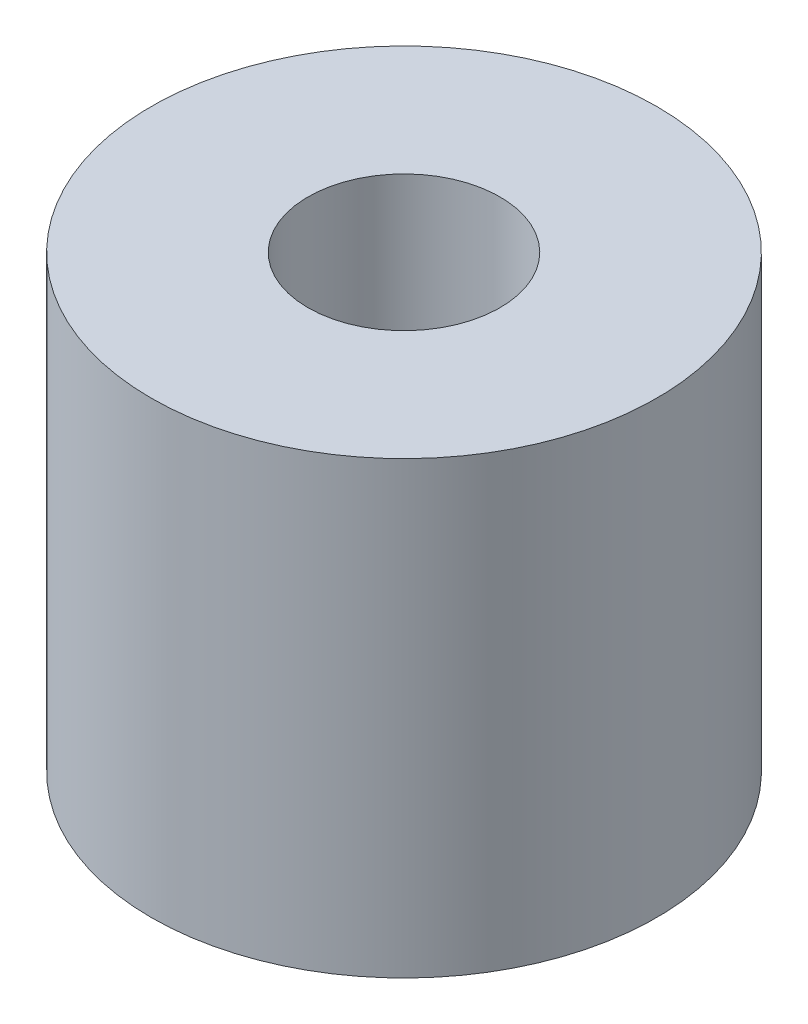
ISO-10303-21;
HEADER;
FILE_DESCRIPTION(('STEP AP214'),'2;1');
FILE_NAME('part.step','',(''),(''),'','','');
FILE_SCHEMA(('AUTOMOTIVE_DESIGN { 1 0 10303 214 1 1 1 1 }'));
ENDSEC;
DATA;
#1=APPLICATION_CONTEXT('core data for automotive mechanical design processes');
#2=APPLICATION_PROTOCOL_DEFINITION('international standard','automotive_design',2000,#1);
#3=PRODUCT_CONTEXT('',#1,'mechanical');
#4=PRODUCT('Part','Part','',(#3));
#5=PRODUCT_RELATED_PRODUCT_CATEGORY('part','',(#4));
#6=PRODUCT_DEFINITION_FORMATION('','',#4);
#7=PRODUCT_DEFINITION_CONTEXT('part definition',#1,'design');
#8=PRODUCT_DEFINITION('design','',#6,#7);
#9=PRODUCT_DEFINITION_SHAPE('','',#8);
#10=(LENGTH_UNIT() NAMED_UNIT(*) SI_UNIT(.MILLI.,.METRE.));
#11=(NAMED_UNIT(*) PLANE_ANGLE_UNIT() SI_UNIT($,.RADIAN.));
#12=(NAMED_UNIT(*) SI_UNIT($,.STERADIAN.) SOLID_ANGLE_UNIT());
#13=UNCERTAINTY_MEASURE_WITH_UNIT(LENGTH_MEASURE(1.E-05),#10,'distance_accuracy_value','');
#14=(GEOMETRIC_REPRESENTATION_CONTEXT(3) GLOBAL_UNCERTAINTY_ASSIGNED_CONTEXT((#13)) GLOBAL_UNIT_ASSIGNED_CONTEXT((#10,
#11,#12)) REPRESENTATION_CONTEXT('',''));
#15=CARTESIAN_POINT('',(0.,0.,0.));
#16=DIRECTION('',(0.,0.,1.));
#17=DIRECTION('',(1.,0.,0.));
#18=AXIS2_PLACEMENT_3D('',#15,#16,#17);
#19=CARTESIAN_POINT('',(0.,22.606,0.));
#20=DIRECTION('',(0.,1.,0.));
#21=DIRECTION('',(0.,0.,1.));
#22=AXIS2_PLACEMENT_3D('',#19,#20,#21);
#23=PLANE('',#22);
#24=CARTESIAN_POINT('',(0.,22.606,0.));
#25=DIRECTION('',(0.,1.,0.));
#26=DIRECTION('',(0.,0.,1.));
#27=AXIS2_PLACEMENT_3D('',#24,#25,#26);
#28=CIRCLE('',#27,12.7);
#29=CARTESIAN_POINT('',(0.,22.606,12.7));
#30=VERTEX_POINT('',#29);
#31=EDGE_CURVE('E10',#30,#30,#28,.T.);
#32=ORIENTED_EDGE('',*,*,#31,.T.);
#33=EDGE_LOOP('',(#32));
#34=FACE_BOUND('',#33,.T.);
#35=CARTESIAN_POINT('',(0.,22.606,0.));
#36=DIRECTION('',(0.,1.,0.));
#37=DIRECTION('',(0.,0.,1.));
#38=AXIS2_PLACEMENT_3D('',#35,#36,#37);
#39=CIRCLE('',#38,4.826);
#40=CARTESIAN_POINT('',(0.,22.606,4.826));
#41=VERTEX_POINT('',#40);
#42=EDGE_CURVE('E42',#41,#41,#39,.T.);
#43=ORIENTED_EDGE('',*,*,#42,.F.);
#44=EDGE_LOOP('',(#43));
#45=FACE_BOUND('',#44,.T.);
#46=ADVANCED_FACE('F31',(#34,#45),#23,.T.);
#47=CARTESIAN_POINT('',(0.,0.,0.));
#48=DIRECTION('',(0.,1.,0.));
#49=DIRECTION('',(0.,0.,1.));
#50=AXIS2_PLACEMENT_3D('',#47,#48,#49);
#51=PLANE('',#50);
#52=CARTESIAN_POINT('',(0.,0.,0.));
#53=DIRECTION('',(0.,1.,0.));
#54=DIRECTION('',(0.,0.,1.));
#55=AXIS2_PLACEMENT_3D('',#52,#53,#54);
#56=CIRCLE('',#55,12.7);
#57=CARTESIAN_POINT('',(0.,0.,12.7));
#58=VERTEX_POINT('',#57);
#59=EDGE_CURVE('E35',#58,#58,#56,.T.);
#60=ORIENTED_EDGE('',*,*,#59,.F.);
#61=EDGE_LOOP('',(#60));
#62=FACE_BOUND('',#61,.T.);
#63=CARTESIAN_POINT('',(0.,0.,0.));
#64=DIRECTION('',(0.,1.,0.));
#65=DIRECTION('',(0.,0.,1.));
#66=AXIS2_PLACEMENT_3D('',#63,#64,#65);
#67=CIRCLE('',#66,4.826);
#68=CARTESIAN_POINT('',(0.,0.,4.826));
#69=VERTEX_POINT('',#68);
#70=EDGE_CURVE('E44',#69,#69,#67,.T.);
#71=ORIENTED_EDGE('',*,*,#70,.T.);
#72=EDGE_LOOP('',(#71));
#73=FACE_BOUND('',#72,.T.);
#74=ADVANCED_FACE('F54',(#62,#73),#51,.F.);
#75=CARTESIAN_POINT('',(0.,22.606,0.));
#76=DIRECTION('',(0.,-1.,0.));
#77=DIRECTION('',(0.,0.,-1.));
#78=AXIS2_PLACEMENT_3D('',#75,#76,#77);
#79=CYLINDRICAL_SURFACE('',#78,12.7);
#80=ORIENTED_EDGE('',*,*,#31,.F.);
#81=EDGE_LOOP('',(#80));
#82=FACE_BOUND('',#81,.T.);
#83=ORIENTED_EDGE('',*,*,#59,.T.);
#84=EDGE_LOOP('',(#83));
#85=FACE_BOUND('',#84,.T.);
#86=ADVANCED_FACE('F33',(#82,#85),#79,.T.);
#87=CARTESIAN_POINT('',(0.,22.606,0.));
#88=DIRECTION('',(0.,-1.,0.));
#89=DIRECTION('',(0.,0.,-1.));
#90=AXIS2_PLACEMENT_3D('',#87,#88,#89);
#91=CYLINDRICAL_SURFACE('',#90,4.826);
#92=ORIENTED_EDGE('',*,*,#42,.T.);
#93=EDGE_LOOP('',(#92));
#94=FACE_BOUND('',#93,.T.);
#95=ORIENTED_EDGE('',*,*,#70,.F.);
#96=EDGE_LOOP('',(#95));
#97=FACE_BOUND('',#96,.T.);
#98=ADVANCED_FACE('F50',(#94,#97),#91,.F.);
#99=CLOSED_SHELL('',(#46,#74,#86,#98));
#100=MANIFOLD_SOLID_BREP('B2',#99);
#101=ADVANCED_BREP_SHAPE_REPRESENTATION('',(#18,#100),#14);
#102=SHAPE_DEFINITION_REPRESENTATION(#9,#101);
ENDSEC;
END-ISO-10303-21;
